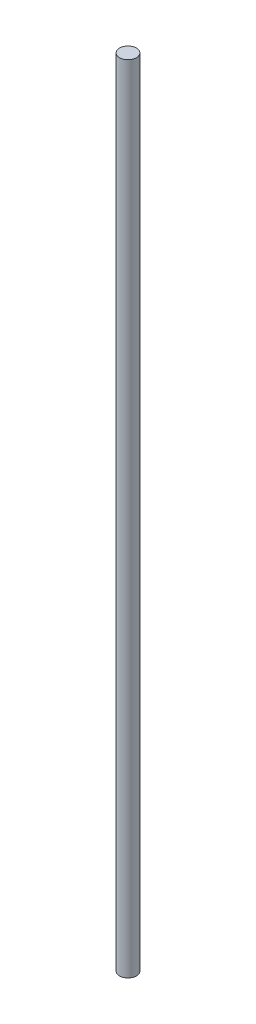
ISO-10303-21;
HEADER;
FILE_DESCRIPTION(('STEP AP214'),'2;1');
FILE_NAME('part.step','',(''),(''),'','','');
FILE_SCHEMA(('AUTOMOTIVE_DESIGN { 1 0 10303 214 1 1 1 1 }'));
ENDSEC;
DATA;
#1=APPLICATION_CONTEXT('core data for automotive mechanical design processes');
#2=APPLICATION_PROTOCOL_DEFINITION('international standard','automotive_design',2000,#1);
#3=PRODUCT_CONTEXT('',#1,'mechanical');
#4=PRODUCT('Part','Part','',(#3));
#5=PRODUCT_RELATED_PRODUCT_CATEGORY('part','',(#4));
#6=PRODUCT_DEFINITION_FORMATION('','',#4);
#7=PRODUCT_DEFINITION_CONTEXT('part definition',#1,'design');
#8=PRODUCT_DEFINITION('design','',#6,#7);
#9=PRODUCT_DEFINITION_SHAPE('','',#8);
#10=(LENGTH_UNIT() NAMED_UNIT(*) SI_UNIT(.MILLI.,.METRE.));
#11=(NAMED_UNIT(*) PLANE_ANGLE_UNIT() SI_UNIT($,.RADIAN.));
#12=(NAMED_UNIT(*) SI_UNIT($,.STERADIAN.) SOLID_ANGLE_UNIT());
#13=UNCERTAINTY_MEASURE_WITH_UNIT(LENGTH_MEASURE(1.E-05),#10,'distance_accuracy_value','');
#14=(GEOMETRIC_REPRESENTATION_CONTEXT(3) GLOBAL_UNCERTAINTY_ASSIGNED_CONTEXT((#13)) GLOBAL_UNIT_ASSIGNED_CONTEXT((#10,
#11,#12)) REPRESENTATION_CONTEXT('',''));
#15=CARTESIAN_POINT('',(0.,0.,0.));
#16=DIRECTION('',(0.,0.,1.));
#17=DIRECTION('',(1.,0.,0.));
#18=AXIS2_PLACEMENT_3D('',#15,#16,#17);
#19=CARTESIAN_POINT('',(0.,284.,0.));
#20=DIRECTION('',(0.,-1.,0.));
#21=DIRECTION('',(0.,0.,-1.));
#22=AXIS2_PLACEMENT_3D('',#19,#20,#21);
#23=CYLINDRICAL_SURFACE('',#22,3.);
#24=CARTESIAN_POINT('',(0.,284.,0.));
#25=DIRECTION('',(0.,1.,0.));
#26=DIRECTION('',(0.,0.,1.));
#27=AXIS2_PLACEMENT_3D('',#24,#25,#26);
#28=CIRCLE('',#27,3.);
#29=CARTESIAN_POINT('',(0.,284.,3.));
#30=VERTEX_POINT('',#29);
#31=EDGE_CURVE('E10',#30,#30,#28,.T.);
#32=ORIENTED_EDGE('',*,*,#31,.F.);
#33=EDGE_LOOP('',(#32));
#34=FACE_BOUND('',#33,.T.);
#35=CARTESIAN_POINT('',(0.,0.,0.));
#36=DIRECTION('',(0.,1.,0.));
#37=DIRECTION('',(0.,0.,1.));
#38=AXIS2_PLACEMENT_3D('',#35,#36,#37);
#39=CIRCLE('',#38,3.);
#40=CARTESIAN_POINT('',(0.,0.,3.));
#41=VERTEX_POINT('',#40);
#42=EDGE_CURVE('E30',#41,#41,#39,.T.);
#43=ORIENTED_EDGE('',*,*,#42,.T.);
#44=EDGE_LOOP('',(#43));
#45=FACE_BOUND('',#44,.T.);
#46=ADVANCED_FACE('F24',(#34,#45),#23,.T.);
#47=CARTESIAN_POINT('',(0.,284.,0.));
#48=DIRECTION('',(0.,1.,0.));
#49=DIRECTION('',(0.,0.,1.));
#50=AXIS2_PLACEMENT_3D('',#47,#48,#49);
#51=PLANE('',#50);
#52=ORIENTED_EDGE('',*,*,#31,.T.);
#53=EDGE_LOOP('',(#52));
#54=FACE_BOUND('',#53,.T.);
#55=ADVANCED_FACE('F39',(#54),#51,.T.);
#56=CARTESIAN_POINT('',(0.,0.,0.));
#57=DIRECTION('',(0.,1.,0.));
#58=DIRECTION('',(0.,0.,1.));
#59=AXIS2_PLACEMENT_3D('',#56,#57,#58);
#60=PLANE('',#59);
#61=ORIENTED_EDGE('',*,*,#42,.F.);
#62=EDGE_LOOP('',(#61));
#63=FACE_BOUND('',#62,.T.);
#64=ADVANCED_FACE('F37',(#63),#60,.F.);
#65=CLOSED_SHELL('',(#46,#55,#64));
#66=MANIFOLD_SOLID_BREP('B2',#65);
#67=ADVANCED_BREP_SHAPE_REPRESENTATION('',(#18,#66),#14);
#68=SHAPE_DEFINITION_REPRESENTATION(#9,#67);
ENDSEC;
END-ISO-10303-21;
